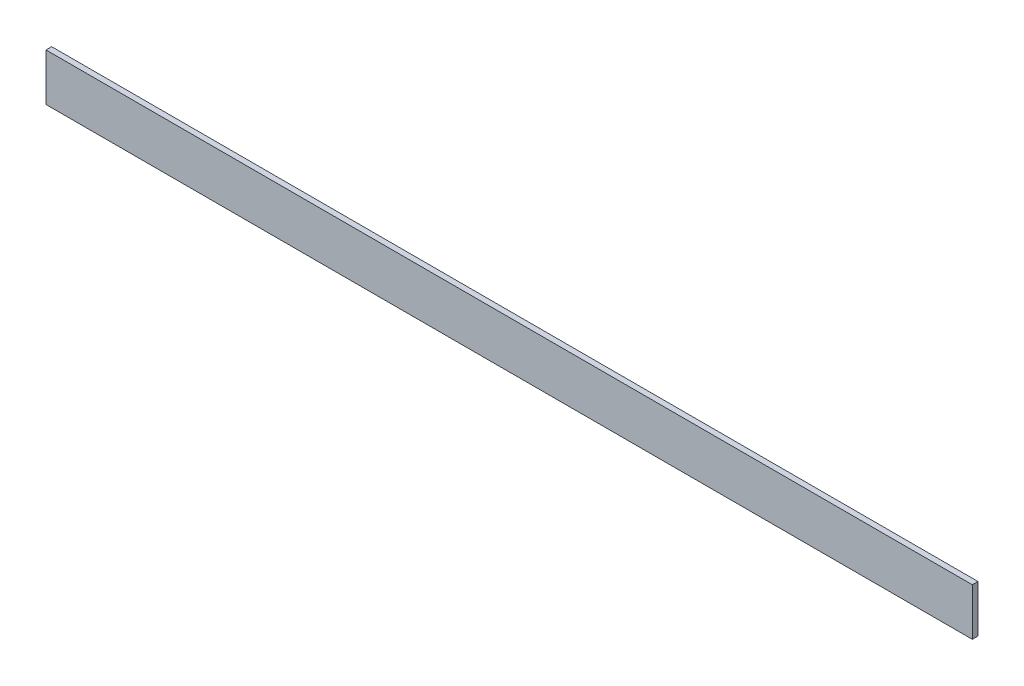
ISO-10303-21;
HEADER;
FILE_DESCRIPTION(('STEP AP214'),'2;1');
FILE_NAME('part.step','',(''),(''),'','','');
FILE_SCHEMA(('AUTOMOTIVE_DESIGN { 1 0 10303 214 1 1 1 1 }'));
ENDSEC;
DATA;
#1=APPLICATION_CONTEXT('core data for automotive mechanical design processes');
#2=APPLICATION_PROTOCOL_DEFINITION('international standard','automotive_design',2000,#1);
#3=PRODUCT_CONTEXT('',#1,'mechanical');
#4=PRODUCT('Part','Part','',(#3));
#5=PRODUCT_RELATED_PRODUCT_CATEGORY('part','',(#4));
#6=PRODUCT_DEFINITION_FORMATION('','',#4);
#7=PRODUCT_DEFINITION_CONTEXT('part definition',#1,'design');
#8=PRODUCT_DEFINITION('design','',#6,#7);
#9=PRODUCT_DEFINITION_SHAPE('','',#8);
#10=(LENGTH_UNIT() NAMED_UNIT(*) SI_UNIT(.MILLI.,.METRE.));
#11=(NAMED_UNIT(*) PLANE_ANGLE_UNIT() SI_UNIT($,.RADIAN.));
#12=(NAMED_UNIT(*) SI_UNIT($,.STERADIAN.) SOLID_ANGLE_UNIT());
#13=UNCERTAINTY_MEASURE_WITH_UNIT(LENGTH_MEASURE(1.E-05),#10,'distance_accuracy_value','');
#14=(GEOMETRIC_REPRESENTATION_CONTEXT(3) GLOBAL_UNCERTAINTY_ASSIGNED_CONTEXT((#13)) GLOBAL_UNIT_ASSIGNED_CONTEXT((#10,
#11,#12)) REPRESENTATION_CONTEXT('',''));
#15=CARTESIAN_POINT('',(0.,0.,0.));
#16=DIRECTION('',(0.,0.,1.));
#17=DIRECTION('',(1.,0.,0.));
#18=AXIS2_PLACEMENT_3D('',#15,#16,#17);
#19=CARTESIAN_POINT('',(490.,0.,-3.));
#20=DIRECTION('',(0.,0.,1.));
#21=DIRECTION('',(1.,0.,0.));
#22=AXIS2_PLACEMENT_3D('',#19,#20,#21);
#23=PLANE('',#22);
#24=DIRECTION('',(0.,1.,0.));
#25=VECTOR('',#24,1.);
#26=CARTESIAN_POINT('',(0.,0.,-3.));
#27=LINE('',#26,#25);
#28=CARTESIAN_POINT('',(0.,0.,-3.));
#29=VERTEX_POINT('',#28);
#30=CARTESIAN_POINT('',(0.,25.,-3.));
#31=VERTEX_POINT('',#30);
#32=EDGE_CURVE('E48',#29,#31,#27,.T.);
#33=ORIENTED_EDGE('',*,*,#32,.T.);
#34=DIRECTION('',(-1.,0.,0.));
#35=VECTOR('',#34,1.);
#36=CARTESIAN_POINT('',(490.,25.,-3.));
#37=LINE('',#36,#35);
#38=CARTESIAN_POINT('',(490.,25.,-3.));
#39=VERTEX_POINT('',#38);
#40=EDGE_CURVE('E110',#39,#31,#37,.T.);
#41=ORIENTED_EDGE('',*,*,#40,.F.);
#42=DIRECTION('',(0.,1.,0.));
#43=VECTOR('',#42,1.);
#44=CARTESIAN_POINT('',(490.,0.,-3.));
#45=LINE('',#44,#43);
#46=CARTESIAN_POINT('',(490.,0.,-3.));
#47=VERTEX_POINT('',#46);
#48=EDGE_CURVE('E78',#47,#39,#45,.T.);
#49=ORIENTED_EDGE('',*,*,#48,.F.);
#50=DIRECTION('',(-1.,0.,0.));
#51=VECTOR('',#50,1.);
#52=CARTESIAN_POINT('',(490.,0.,-3.));
#53=LINE('',#52,#51);
#54=CARTESIAN_POINT('',(468.,0.,-3.));
#55=VERTEX_POINT('',#54);
#56=EDGE_CURVE('E108',#47,#55,#53,.T.);
#57=ORIENTED_EDGE('',*,*,#56,.T.);
#58=DIRECTION('',(0.,-1.,0.));
#59=VECTOR('',#58,1.);
#60=CARTESIAN_POINT('',(468.,25.,-3.));
#61=LINE('',#60,#59);
#62=CARTESIAN_POINT('',(468.,3.,-3.));
#63=VERTEX_POINT('',#62);
#64=EDGE_CURVE('E174',#63,#55,#61,.T.);
#65=ORIENTED_EDGE('',*,*,#64,.F.);
#66=DIRECTION('',(-1.,0.,0.));
#67=VECTOR('',#66,1.);
#68=CARTESIAN_POINT('',(490.,3.,-3.));
#69=LINE('',#68,#67);
#70=CARTESIAN_POINT('',(22.,3.,-3.));
#71=VERTEX_POINT('',#70);
#72=EDGE_CURVE('E122',#63,#71,#69,.T.);
#73=ORIENTED_EDGE('',*,*,#72,.T.);
#74=DIRECTION('',(0.,-1.,0.));
#75=VECTOR('',#74,1.);
#76=CARTESIAN_POINT('',(22.,25.,-3.));
#77=LINE('',#76,#75);
#78=CARTESIAN_POINT('',(22.,0.,-3.));
#79=VERTEX_POINT('',#78);
#80=EDGE_CURVE('E131',#71,#79,#77,.T.);
#81=ORIENTED_EDGE('',*,*,#80,.T.);
#82=DIRECTION('',(-1.,0.,0.));
#83=VECTOR('',#82,1.);
#84=CARTESIAN_POINT('',(0.,0.,-3.));
#85=LINE('',#84,#83);
#86=EDGE_CURVE('E160',#79,#29,#85,.T.);
#87=ORIENTED_EDGE('',*,*,#86,.T.);
#88=EDGE_LOOP('',(#33,#41,#49,#57,#65,#73,#81,#87));
#89=FACE_BOUND('',#88,.T.);
#90=ADVANCED_FACE('F34',(#89),#23,.F.);
#91=CARTESIAN_POINT('',(490.,25.,0.));
#92=DIRECTION('',(0.,1.,0.));
#93=DIRECTION('',(0.,0.,1.));
#94=AXIS2_PLACEMENT_3D('',#91,#92,#93);
#95=PLANE('',#94);
#96=DIRECTION('',(0.,0.,-1.));
#97=VECTOR('',#96,1.);
#98=CARTESIAN_POINT('',(0.,25.,0.));
#99=LINE('',#98,#97);
#100=CARTESIAN_POINT('',(0.,25.,0.));
#101=VERTEX_POINT('',#100);
#102=EDGE_CURVE('E130',#101,#31,#99,.T.);
#103=ORIENTED_EDGE('',*,*,#102,.F.);
#104=DIRECTION('',(-1.,0.,0.));
#105=VECTOR('',#104,1.);
#106=CARTESIAN_POINT('',(490.,25.,0.));
#107=LINE('',#106,#105);
#108=CARTESIAN_POINT('',(490.,25.,0.));
#109=VERTEX_POINT('',#108);
#110=EDGE_CURVE('E141',#109,#101,#107,.T.);
#111=ORIENTED_EDGE('',*,*,#110,.F.);
#112=DIRECTION('',(0.,0.,-1.));
#113=VECTOR('',#112,1.);
#114=CARTESIAN_POINT('',(490.,25.,0.));
#115=LINE('',#114,#113);
#116=EDGE_CURVE('E112',#109,#39,#115,.T.);
#117=ORIENTED_EDGE('',*,*,#116,.T.);
#118=ORIENTED_EDGE('',*,*,#40,.T.);
#119=EDGE_LOOP('',(#103,#111,#117,#118));
#120=FACE_BOUND('',#119,.T.);
#121=ADVANCED_FACE('F167',(#120),#95,.T.);
#122=CARTESIAN_POINT('',(490.,0.,0.));
#123=DIRECTION('',(0.,0.,1.));
#124=DIRECTION('',(1.,0.,0.));
#125=AXIS2_PLACEMENT_3D('',#122,#123,#124);
#126=PLANE('',#125);
#127=DIRECTION('',(0.,1.,0.));
#128=VECTOR('',#127,1.);
#129=CARTESIAN_POINT('',(0.,0.,0.));
#130=LINE('',#129,#128);
#131=CARTESIAN_POINT('',(0.,0.,0.));
#132=VERTEX_POINT('',#131);
#133=EDGE_CURVE('E133',#132,#101,#130,.T.);
#134=ORIENTED_EDGE('',*,*,#133,.F.);
#135=DIRECTION('',(-1.,0.,0.));
#136=VECTOR('',#135,1.);
#137=CARTESIAN_POINT('',(490.,0.,0.));
#138=LINE('',#137,#136);
#139=CARTESIAN_POINT('',(490.,0.,0.));
#140=VERTEX_POINT('',#139);
#141=EDGE_CURVE('E139',#140,#132,#138,.T.);
#142=ORIENTED_EDGE('',*,*,#141,.F.);
#143=DIRECTION('',(0.,1.,0.));
#144=VECTOR('',#143,1.);
#145=CARTESIAN_POINT('',(490.,0.,0.));
#146=LINE('',#145,#144);
#147=EDGE_CURVE('E121',#140,#109,#146,.T.);
#148=ORIENTED_EDGE('',*,*,#147,.T.);
#149=ORIENTED_EDGE('',*,*,#110,.T.);
#150=EDGE_LOOP('',(#134,#142,#148,#149));
#151=FACE_BOUND('',#150,.T.);
#152=ADVANCED_FACE('F170',(#151),#126,.T.);
#153=CARTESIAN_POINT('',(490.,0.,0.));
#154=DIRECTION('',(0.,-1.,0.));
#155=DIRECTION('',(0.,0.,-1.));
#156=AXIS2_PLACEMENT_3D('',#153,#154,#155);
#157=PLANE('',#156);
#158=DIRECTION('',(0.,0.,-1.));
#159=VECTOR('',#158,1.);
#160=CARTESIAN_POINT('',(468.,0.,-25.));
#161=LINE('',#160,#159);
#162=CARTESIAN_POINT('',(468.,0.,-25.));
#163=VERTEX_POINT('',#162);
#164=EDGE_CURVE('E116',#55,#163,#161,.T.);
#165=ORIENTED_EDGE('',*,*,#164,.F.);
#166=ORIENTED_EDGE('',*,*,#56,.F.);
#167=DIRECTION('',(0.,0.,1.));
#168=VECTOR('',#167,1.);
#169=CARTESIAN_POINT('',(490.,0.,0.));
#170=LINE('',#169,#168);
#171=EDGE_CURVE('E57',#47,#140,#170,.T.);
#172=ORIENTED_EDGE('',*,*,#171,.T.);
#173=ORIENTED_EDGE('',*,*,#141,.T.);
#174=DIRECTION('',(0.,0.,1.));
#175=VECTOR('',#174,1.);
#176=CARTESIAN_POINT('',(0.,0.,0.));
#177=LINE('',#176,#175);
#178=EDGE_CURVE('E73',#29,#132,#177,.T.);
#179=ORIENTED_EDGE('',*,*,#178,.F.);
#180=ORIENTED_EDGE('',*,*,#86,.F.);
#181=DIRECTION('',(0.,0.,1.));
#182=VECTOR('',#181,1.);
#183=CARTESIAN_POINT('',(22.,0.,-25.));
#184=LINE('',#183,#182);
#185=CARTESIAN_POINT('',(22.,0.,-25.));
#186=VERTEX_POINT('',#185);
#187=EDGE_CURVE('E163',#186,#79,#184,.T.);
#188=ORIENTED_EDGE('',*,*,#187,.F.);
#189=DIRECTION('',(-1.,0.,0.));
#190=VECTOR('',#189,1.);
#191=CARTESIAN_POINT('',(490.,0.,-25.));
#192=LINE('',#191,#190);
#193=EDGE_CURVE('E137',#163,#186,#192,.T.);
#194=ORIENTED_EDGE('',*,*,#193,.F.);
#195=EDGE_LOOP('',(#165,#166,#172,#173,#179,#180,#188,#194));
#196=FACE_BOUND('',#195,.T.);
#197=ADVANCED_FACE('F114',(#196),#157,.T.);
#198=CARTESIAN_POINT('',(490.,3.,-25.));
#199=DIRECTION('',(0.,0.,-1.));
#200=DIRECTION('',(-1.,0.,0.));
#201=AXIS2_PLACEMENT_3D('',#198,#199,#200);
#202=PLANE('',#201);
#203=DIRECTION('',(0.,-1.,0.));
#204=VECTOR('',#203,1.);
#205=CARTESIAN_POINT('',(468.,25.,-25.));
#206=LINE('',#205,#204);
#207=CARTESIAN_POINT('',(468.,3.,-25.));
#208=VERTEX_POINT('',#207);
#209=EDGE_CURVE('E172',#208,#163,#206,.T.);
#210=ORIENTED_EDGE('',*,*,#209,.T.);
#211=ORIENTED_EDGE('',*,*,#193,.T.);
#212=DIRECTION('',(0.,-1.,0.));
#213=VECTOR('',#212,1.);
#214=CARTESIAN_POINT('',(22.,25.,-25.));
#215=LINE('',#214,#213);
#216=CARTESIAN_POINT('',(22.,3.,-25.));
#217=VERTEX_POINT('',#216);
#218=EDGE_CURVE('E155',#217,#186,#215,.T.);
#219=ORIENTED_EDGE('',*,*,#218,.F.);
#220=DIRECTION('',(-1.,0.,0.));
#221=VECTOR('',#220,1.);
#222=CARTESIAN_POINT('',(490.,3.,-25.));
#223=LINE('',#222,#221);
#224=EDGE_CURVE('E124',#208,#217,#223,.T.);
#225=ORIENTED_EDGE('',*,*,#224,.F.);
#226=EDGE_LOOP('',(#210,#211,#219,#225));
#227=FACE_BOUND('',#226,.T.);
#228=ADVANCED_FACE('F159',(#227),#202,.T.);
#229=CARTESIAN_POINT('',(490.,3.,0.));
#230=DIRECTION('',(0.,-1.,0.));
#231=DIRECTION('',(0.,0.,-1.));
#232=AXIS2_PLACEMENT_3D('',#229,#230,#231);
#233=PLANE('',#232);
#234=ORIENTED_EDGE('',*,*,#72,.F.);
#235=DIRECTION('',(0.,0.,-1.));
#236=VECTOR('',#235,1.);
#237=CARTESIAN_POINT('',(468.,3.,0.));
#238=LINE('',#237,#236);
#239=EDGE_CURVE('E11',#63,#208,#238,.T.);
#240=ORIENTED_EDGE('',*,*,#239,.T.);
#241=ORIENTED_EDGE('',*,*,#224,.T.);
#242=DIRECTION('',(0.,0.,1.));
#243=VECTOR('',#242,1.);
#244=CARTESIAN_POINT('',(22.,3.,0.));
#245=LINE('',#244,#243);
#246=EDGE_CURVE('E41',#217,#71,#245,.T.);
#247=ORIENTED_EDGE('',*,*,#246,.T.);
#248=EDGE_LOOP('',(#234,#240,#241,#247));
#249=FACE_BOUND('',#248,.T.);
#250=ADVANCED_FACE('F147',(#249),#233,.F.);
#251=CARTESIAN_POINT('',(490.,0.,0.));
#252=DIRECTION('',(-1.,0.,0.));
#253=DIRECTION('',(0.,0.,1.));
#254=AXIS2_PLACEMENT_3D('',#251,#252,#253);
#255=PLANE('',#254);
#256=ORIENTED_EDGE('',*,*,#171,.F.);
#257=ORIENTED_EDGE('',*,*,#48,.T.);
#258=ORIENTED_EDGE('',*,*,#116,.F.);
#259=ORIENTED_EDGE('',*,*,#147,.F.);
#260=EDGE_LOOP('',(#256,#257,#258,#259));
#261=FACE_BOUND('',#260,.T.);
#262=ADVANCED_FACE('F119',(#261),#255,.F.);
#263=CARTESIAN_POINT('',(0.,0.,0.));
#264=DIRECTION('',(-1.,0.,0.));
#265=DIRECTION('',(0.,0.,1.));
#266=AXIS2_PLACEMENT_3D('',#263,#264,#265);
#267=PLANE('',#266);
#268=ORIENTED_EDGE('',*,*,#32,.F.);
#269=ORIENTED_EDGE('',*,*,#178,.T.);
#270=ORIENTED_EDGE('',*,*,#133,.T.);
#271=ORIENTED_EDGE('',*,*,#102,.T.);
#272=EDGE_LOOP('',(#268,#269,#270,#271));
#273=FACE_BOUND('',#272,.T.);
#274=ADVANCED_FACE('F185',(#273),#267,.T.);
#275=CARTESIAN_POINT('',(22.,25.,-25.));
#276=DIRECTION('',(1.,0.,0.));
#277=DIRECTION('',(0.,0.,-1.));
#278=AXIS2_PLACEMENT_3D('',#275,#276,#277);
#279=PLANE('',#278);
#280=ORIENTED_EDGE('',*,*,#218,.T.);
#281=ORIENTED_EDGE('',*,*,#187,.T.);
#282=ORIENTED_EDGE('',*,*,#80,.F.);
#283=ORIENTED_EDGE('',*,*,#246,.F.);
#284=EDGE_LOOP('',(#280,#281,#282,#283));
#285=FACE_BOUND('',#284,.T.);
#286=ADVANCED_FACE('F153',(#285),#279,.F.);
#287=CARTESIAN_POINT('',(468.,25.,-25.));
#288=DIRECTION('',(-1.,0.,0.));
#289=DIRECTION('',(0.,0.,1.));
#290=AXIS2_PLACEMENT_3D('',#287,#288,#289);
#291=PLANE('',#290);
#292=ORIENTED_EDGE('',*,*,#64,.T.);
#293=ORIENTED_EDGE('',*,*,#164,.T.);
#294=ORIENTED_EDGE('',*,*,#209,.F.);
#295=ORIENTED_EDGE('',*,*,#239,.F.);
#296=EDGE_LOOP('',(#292,#293,#294,#295));
#297=FACE_BOUND('',#296,.T.);
#298=ADVANCED_FACE('F179',(#297),#291,.F.);
#299=CLOSED_SHELL('',(#90,#121,#152,#197,#228,#250,#262,#274,#286,#298));
#300=MANIFOLD_SOLID_BREP('B2',#299);
#301=ADVANCED_BREP_SHAPE_REPRESENTATION('',(#18,#300),#14);
#302=SHAPE_DEFINITION_REPRESENTATION(#9,#301);
ENDSEC;
END-ISO-10303-21;
